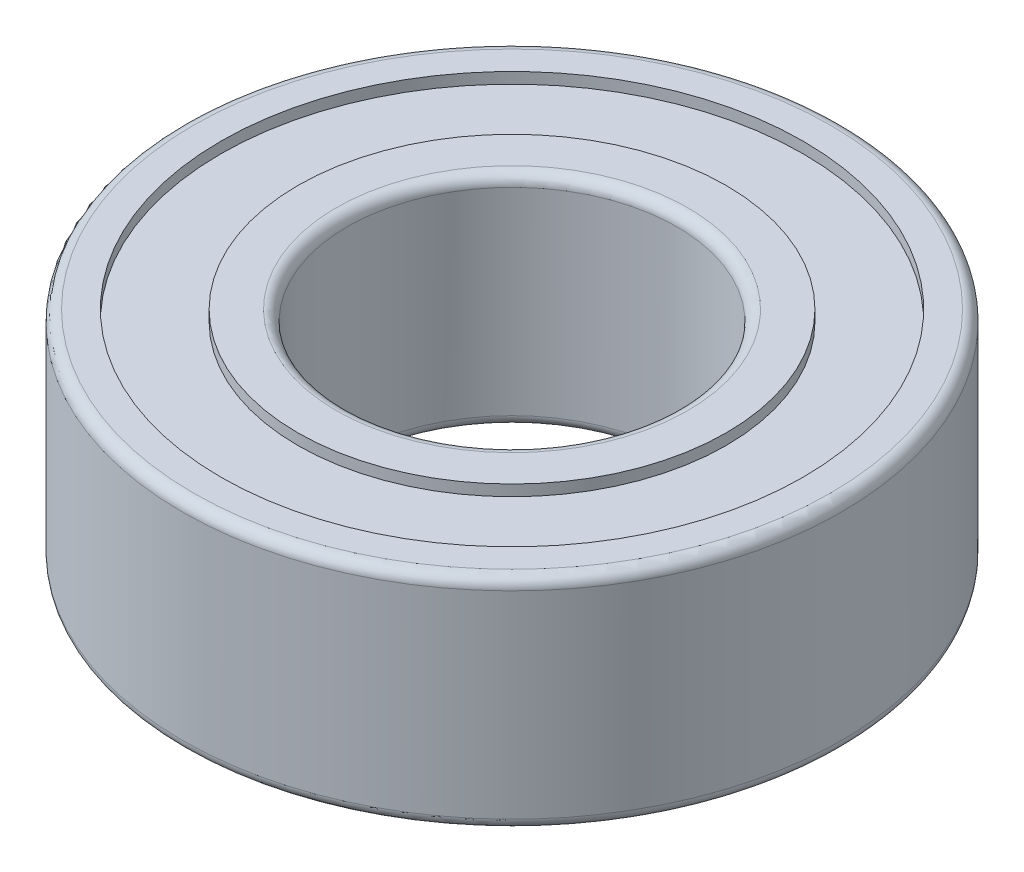
ISO-10303-21;
HEADER;
FILE_DESCRIPTION(('STEP AP214'),'2;1');
FILE_NAME('part.step','',(''),(''),'','','');
FILE_SCHEMA(('AUTOMOTIVE_DESIGN { 1 0 10303 214 1 1 1 1 }'));
ENDSEC;
DATA;
#1=APPLICATION_CONTEXT('core data for automotive mechanical design processes');
#2=APPLICATION_PROTOCOL_DEFINITION('international standard','automotive_design',2000,#1);
#3=PRODUCT_CONTEXT('',#1,'mechanical');
#4=PRODUCT('Part','Part','',(#3));
#5=PRODUCT_RELATED_PRODUCT_CATEGORY('part','',(#4));
#6=PRODUCT_DEFINITION_FORMATION('','',#4);
#7=PRODUCT_DEFINITION_CONTEXT('part definition',#1,'design');
#8=PRODUCT_DEFINITION('design','',#6,#7);
#9=PRODUCT_DEFINITION_SHAPE('','',#8);
#10=(LENGTH_UNIT() NAMED_UNIT(*) SI_UNIT(.MILLI.,.METRE.));
#11=(NAMED_UNIT(*) PLANE_ANGLE_UNIT() SI_UNIT($,.RADIAN.));
#12=(NAMED_UNIT(*) SI_UNIT($,.STERADIAN.) SOLID_ANGLE_UNIT());
#13=UNCERTAINTY_MEASURE_WITH_UNIT(LENGTH_MEASURE(1.E-05),#10,'distance_accuracy_value','');
#14=(GEOMETRIC_REPRESENTATION_CONTEXT(3) GLOBAL_UNCERTAINTY_ASSIGNED_CONTEXT((#13)) GLOBAL_UNIT_ASSIGNED_CONTEXT((#10,
#11,#12)) REPRESENTATION_CONTEXT('',''));
#15=CARTESIAN_POINT('',(0.,0.,0.));
#16=DIRECTION('',(0.,0.,1.));
#17=DIRECTION('',(1.,0.,0.));
#18=AXIS2_PLACEMENT_3D('',#15,#16,#17);
#19=CARTESIAN_POINT('',(0.,15.2038834951456,0.));
#20=DIRECTION('',(0.,1.,0.));
#21=DIRECTION('',(0.,0.,1.));
#22=AXIS2_PLACEMENT_3D('',#19,#20,#21);
#23=CYLINDRICAL_SURFACE('',#22,6.);
#24=CARTESIAN_POINT('',(0.,-1.8,0.));
#25=DIRECTION('',(0.,-1.,0.));
#26=DIRECTION('',(0.,0.,-1.));
#27=AXIS2_PLACEMENT_3D('',#24,#25,#26);
#28=CIRCLE('',#27,6.);
#29=CARTESIAN_POINT('',(0.,-1.8,-6.));
#30=VERTEX_POINT('',#29);
#31=EDGE_CURVE('E64',#30,#30,#28,.F.);
#32=ORIENTED_EDGE('',*,*,#31,.T.);
#33=EDGE_LOOP('',(#32));
#34=FACE_BOUND('',#33,.T.);
#35=CARTESIAN_POINT('',(0.,1.8,0.));
#36=DIRECTION('',(0.,1.,0.));
#37=DIRECTION('',(0.,0.,1.));
#38=AXIS2_PLACEMENT_3D('',#35,#36,#37);
#39=CIRCLE('',#38,6.);
#40=CARTESIAN_POINT('',(0.,1.8,6.));
#41=VERTEX_POINT('',#40);
#42=EDGE_CURVE('E78',#41,#41,#39,.F.);
#43=ORIENTED_EDGE('',*,*,#42,.T.);
#44=EDGE_LOOP('',(#43));
#45=FACE_BOUND('',#44,.T.);
#46=ADVANCED_FACE('F44',(#34,#45),#23,.T.);
#47=CARTESIAN_POINT('',(0.,2.,6.));
#48=DIRECTION('',(0.,1.,0.));
#49=DIRECTION('',(0.,0.,1.));
#50=AXIS2_PLACEMENT_3D('',#47,#48,#49);
#51=PLANE('',#50);
#52=CARTESIAN_POINT('',(0.,2.,0.));
#53=DIRECTION('',(0.,1.,0.));
#54=DIRECTION('',(0.,0.,1.));
#55=AXIS2_PLACEMENT_3D('',#52,#53,#54);
#56=CIRCLE('',#55,5.8);
#57=CARTESIAN_POINT('',(0.,2.,5.8));
#58=VERTEX_POINT('',#57);
#59=EDGE_CURVE('E81',#58,#58,#56,.T.);
#60=ORIENTED_EDGE('',*,*,#59,.T.);
#61=EDGE_LOOP('',(#60));
#62=FACE_BOUND('',#61,.T.);
#63=CARTESIAN_POINT('',(0.,2.,0.));
#64=DIRECTION('',(0.,1.,0.));
#65=DIRECTION('',(0.,0.,1.));
#66=AXIS2_PLACEMENT_3D('',#63,#64,#65);
#67=CIRCLE('',#66,5.3);
#68=CARTESIAN_POINT('',(0.,2.,5.3));
#69=VERTEX_POINT('',#68);
#70=EDGE_CURVE('E85',#69,#69,#67,.T.);
#71=ORIENTED_EDGE('',*,*,#70,.F.);
#72=EDGE_LOOP('',(#71));
#73=FACE_BOUND('',#72,.T.);
#74=ADVANCED_FACE('F132',(#62,#73),#51,.T.);
#75=CARTESIAN_POINT('',(0.,15.2038834951456,0.));
#76=DIRECTION('',(0.,1.,0.));
#77=DIRECTION('',(0.,0.,1.));
#78=AXIS2_PLACEMENT_3D('',#75,#76,#77);
#79=CYLINDRICAL_SURFACE('',#78,5.3);
#80=ORIENTED_EDGE('',*,*,#70,.T.);
#81=EDGE_LOOP('',(#80));
#82=FACE_BOUND('',#81,.T.);
#83=CARTESIAN_POINT('',(0.,1.8,0.));
#84=DIRECTION('',(0.,1.,0.));
#85=DIRECTION('',(0.,0.,1.));
#86=AXIS2_PLACEMENT_3D('',#83,#84,#85);
#87=CIRCLE('',#86,5.3);
#88=CARTESIAN_POINT('',(0.,1.8,5.3));
#89=VERTEX_POINT('',#88);
#90=EDGE_CURVE('E89',#89,#89,#87,.T.);
#91=ORIENTED_EDGE('',*,*,#90,.F.);
#92=EDGE_LOOP('',(#91));
#93=FACE_BOUND('',#92,.T.);
#94=ADVANCED_FACE('F138',(#82,#93),#79,.F.);
#95=CARTESIAN_POINT('',(0.,1.8,5.3));
#96=DIRECTION('',(0.,1.,0.));
#97=DIRECTION('',(0.,0.,1.));
#98=AXIS2_PLACEMENT_3D('',#95,#96,#97);
#99=PLANE('',#98);
#100=ORIENTED_EDGE('',*,*,#90,.T.);
#101=EDGE_LOOP('',(#100));
#102=FACE_BOUND('',#101,.T.);
#103=CARTESIAN_POINT('',(0.,1.8,0.));
#104=DIRECTION('',(0.,1.,0.));
#105=DIRECTION('',(0.,0.,1.));
#106=AXIS2_PLACEMENT_3D('',#103,#104,#105);
#107=CIRCLE('',#106,3.9);
#108=CARTESIAN_POINT('',(0.,1.8,3.9));
#109=VERTEX_POINT('',#108);
#110=EDGE_CURVE('E93',#109,#109,#107,.T.);
#111=ORIENTED_EDGE('',*,*,#110,.F.);
#112=EDGE_LOOP('',(#111));
#113=FACE_BOUND('',#112,.T.);
#114=ADVANCED_FACE('F176',(#102,#113),#99,.T.);
#115=CARTESIAN_POINT('',(0.,15.2038834951456,0.));
#116=DIRECTION('',(0.,1.,0.));
#117=DIRECTION('',(0.,0.,1.));
#118=AXIS2_PLACEMENT_3D('',#115,#116,#117);
#119=CYLINDRICAL_SURFACE('',#118,3.9);
#120=ORIENTED_EDGE('',*,*,#110,.T.);
#121=EDGE_LOOP('',(#120));
#122=FACE_BOUND('',#121,.T.);
#123=CARTESIAN_POINT('',(0.,2.,0.));
#124=DIRECTION('',(0.,1.,0.));
#125=DIRECTION('',(0.,0.,1.));
#126=AXIS2_PLACEMENT_3D('',#123,#124,#125);
#127=CIRCLE('',#126,3.9);
#128=CARTESIAN_POINT('',(0.,2.,3.9));
#129=VERTEX_POINT('',#128);
#130=EDGE_CURVE('E97',#129,#129,#127,.T.);
#131=ORIENTED_EDGE('',*,*,#130,.F.);
#132=EDGE_LOOP('',(#131));
#133=FACE_BOUND('',#132,.T.);
#134=ADVANCED_FACE('F169',(#122,#133),#119,.T.);
#135=CARTESIAN_POINT('',(0.,2.,3.9));
#136=DIRECTION('',(0.,1.,0.));
#137=DIRECTION('',(0.,0.,1.));
#138=AXIS2_PLACEMENT_3D('',#135,#136,#137);
#139=PLANE('',#138);
#140=CARTESIAN_POINT('',(0.,2.,0.));
#141=DIRECTION('',(0.,1.,0.));
#142=DIRECTION('',(0.,0.,1.));
#143=AXIS2_PLACEMENT_3D('',#140,#141,#142);
#144=CIRCLE('',#143,3.2);
#145=CARTESIAN_POINT('',(0.,2.,3.2));
#146=VERTEX_POINT('',#145);
#147=EDGE_CURVE('E70',#146,#146,#144,.F.);
#148=ORIENTED_EDGE('',*,*,#147,.T.);
#149=EDGE_LOOP('',(#148));
#150=FACE_BOUND('',#149,.T.);
#151=ORIENTED_EDGE('',*,*,#130,.T.);
#152=EDGE_LOOP('',(#151));
#153=FACE_BOUND('',#152,.T.);
#154=ADVANCED_FACE('F164',(#150,#153),#139,.T.);
#155=CARTESIAN_POINT('',(0.,15.2038834951456,0.));
#156=DIRECTION('',(0.,1.,0.));
#157=DIRECTION('',(0.,0.,1.));
#158=AXIS2_PLACEMENT_3D('',#155,#156,#157);
#159=CYLINDRICAL_SURFACE('',#158,3.);
#160=CARTESIAN_POINT('',(0.,-1.8,0.));
#161=DIRECTION('',(0.,-1.,0.));
#162=DIRECTION('',(0.,0.,-1.));
#163=AXIS2_PLACEMENT_3D('',#160,#161,#162);
#164=CIRCLE('',#163,3.);
#165=CARTESIAN_POINT('',(0.,-1.8,-3.));
#166=VERTEX_POINT('',#165);
#167=EDGE_CURVE('E10',#166,#166,#164,.T.);
#168=ORIENTED_EDGE('',*,*,#167,.T.);
#169=EDGE_LOOP('',(#168));
#170=FACE_BOUND('',#169,.T.);
#171=CARTESIAN_POINT('',(0.,1.8,0.));
#172=DIRECTION('',(0.,1.,0.));
#173=DIRECTION('',(0.,0.,1.));
#174=AXIS2_PLACEMENT_3D('',#171,#172,#173);
#175=CIRCLE('',#174,3.);
#176=CARTESIAN_POINT('',(0.,1.8,3.));
#177=VERTEX_POINT('',#176);
#178=EDGE_CURVE('E74',#177,#177,#175,.T.);
#179=ORIENTED_EDGE('',*,*,#178,.T.);
#180=EDGE_LOOP('',(#179));
#181=FACE_BOUND('',#180,.T.);
#182=ADVANCED_FACE('F148',(#170,#181),#159,.F.);
#183=CARTESIAN_POINT('',(0.,1.8,0.));
#184=DIRECTION('',(0.,1.,0.));
#185=DIRECTION('',(0.,0.,1.));
#186=AXIS2_PLACEMENT_3D('',#183,#184,#185);
#187=TOROIDAL_SURFACE('',#186,5.8,0.2);
#188=ORIENTED_EDGE('',*,*,#42,.F.);
#189=EDGE_LOOP('',(#188));
#190=FACE_BOUND('',#189,.T.);
#191=ORIENTED_EDGE('',*,*,#59,.F.);
#192=EDGE_LOOP('',(#191));
#193=FACE_BOUND('',#192,.T.);
#194=ADVANCED_FACE('F144',(#190,#193),#187,.T.);
#195=CARTESIAN_POINT('',(0.,1.8,0.));
#196=DIRECTION('',(0.,1.,0.));
#197=DIRECTION('',(0.,0.,1.));
#198=AXIS2_PLACEMENT_3D('',#195,#196,#197);
#199=TOROIDAL_SURFACE('',#198,3.2,0.2);
#200=ORIENTED_EDGE('',*,*,#147,.F.);
#201=EDGE_LOOP('',(#200));
#202=FACE_BOUND('',#201,.T.);
#203=ORIENTED_EDGE('',*,*,#178,.F.);
#204=EDGE_LOOP('',(#203));
#205=FACE_BOUND('',#204,.T.);
#206=ADVANCED_FACE('F147',(#202,#205),#199,.T.);
#207=CARTESIAN_POINT('',(0.,-2.,6.));
#208=DIRECTION('',(0.,-1.,0.));
#209=DIRECTION('',(0.,0.,1.));
#210=AXIS2_PLACEMENT_3D('',#207,#208,#209);
#211=PLANE('',#210);
#212=CARTESIAN_POINT('',(0.,-2.,0.));
#213=DIRECTION('',(0.,-1.,0.));
#214=DIRECTION('',(0.,0.,-1.));
#215=AXIS2_PLACEMENT_3D('',#212,#213,#214);
#216=CIRCLE('',#215,5.8);
#217=CARTESIAN_POINT('',(0.,-2.,-5.8));
#218=VERTEX_POINT('',#217);
#219=EDGE_CURVE('E58',#218,#218,#216,.T.);
#220=ORIENTED_EDGE('',*,*,#219,.T.);
#221=EDGE_LOOP('',(#220));
#222=FACE_BOUND('',#221,.T.);
#223=CARTESIAN_POINT('',(0.,-2.,0.));
#224=DIRECTION('',(0.,1.,0.));
#225=DIRECTION('',(0.,0.,1.));
#226=AXIS2_PLACEMENT_3D('',#223,#224,#225);
#227=CIRCLE('',#226,5.3);
#228=CARTESIAN_POINT('',(0.,-2.,5.3));
#229=VERTEX_POINT('',#228);
#230=EDGE_CURVE('E101',#229,#229,#227,.T.);
#231=ORIENTED_EDGE('',*,*,#230,.T.);
#232=EDGE_LOOP('',(#231));
#233=FACE_BOUND('',#232,.T.);
#234=ADVANCED_FACE('F151',(#222,#233),#211,.T.);
#235=CARTESIAN_POINT('',(0.,-15.2038834951456,0.));
#236=DIRECTION('',(0.,-1.,0.));
#237=DIRECTION('',(0.,0.,1.));
#238=AXIS2_PLACEMENT_3D('',#235,#236,#237);
#239=CYLINDRICAL_SURFACE('',#238,5.3);
#240=ORIENTED_EDGE('',*,*,#230,.F.);
#241=EDGE_LOOP('',(#240));
#242=FACE_BOUND('',#241,.T.);
#243=CARTESIAN_POINT('',(0.,-1.8,0.));
#244=DIRECTION('',(0.,1.,0.));
#245=DIRECTION('',(0.,0.,1.));
#246=AXIS2_PLACEMENT_3D('',#243,#244,#245);
#247=CIRCLE('',#246,5.3);
#248=CARTESIAN_POINT('',(0.,-1.8,5.3));
#249=VERTEX_POINT('',#248);
#250=EDGE_CURVE('E105',#249,#249,#247,.T.);
#251=ORIENTED_EDGE('',*,*,#250,.T.);
#252=EDGE_LOOP('',(#251));
#253=FACE_BOUND('',#252,.T.);
#254=ADVANCED_FACE('F156',(#242,#253),#239,.F.);
#255=CARTESIAN_POINT('',(0.,-1.8,5.3));
#256=DIRECTION('',(0.,-1.,0.));
#257=DIRECTION('',(0.,0.,1.));
#258=AXIS2_PLACEMENT_3D('',#255,#256,#257);
#259=PLANE('',#258);
#260=ORIENTED_EDGE('',*,*,#250,.F.);
#261=EDGE_LOOP('',(#260));
#262=FACE_BOUND('',#261,.T.);
#263=CARTESIAN_POINT('',(0.,-1.8,0.));
#264=DIRECTION('',(0.,1.,0.));
#265=DIRECTION('',(0.,0.,1.));
#266=AXIS2_PLACEMENT_3D('',#263,#264,#265);
#267=CIRCLE('',#266,3.9);
#268=CARTESIAN_POINT('',(0.,-1.8,3.9));
#269=VERTEX_POINT('',#268);
#270=EDGE_CURVE('E109',#269,#269,#267,.T.);
#271=ORIENTED_EDGE('',*,*,#270,.T.);
#272=EDGE_LOOP('',(#271));
#273=FACE_BOUND('',#272,.T.);
#274=ADVANCED_FACE('F128',(#262,#273),#259,.T.);
#275=CARTESIAN_POINT('',(0.,-15.2038834951456,0.));
#276=DIRECTION('',(0.,-1.,0.));
#277=DIRECTION('',(0.,0.,1.));
#278=AXIS2_PLACEMENT_3D('',#275,#276,#277);
#279=CYLINDRICAL_SURFACE('',#278,3.9);
#280=ORIENTED_EDGE('',*,*,#270,.F.);
#281=EDGE_LOOP('',(#280));
#282=FACE_BOUND('',#281,.T.);
#283=CARTESIAN_POINT('',(0.,-2.,0.));
#284=DIRECTION('',(0.,1.,0.));
#285=DIRECTION('',(0.,0.,1.));
#286=AXIS2_PLACEMENT_3D('',#283,#284,#285);
#287=CIRCLE('',#286,3.9);
#288=CARTESIAN_POINT('',(0.,-2.,3.9));
#289=VERTEX_POINT('',#288);
#290=EDGE_CURVE('E112',#289,#289,#287,.T.);
#291=ORIENTED_EDGE('',*,*,#290,.T.);
#292=EDGE_LOOP('',(#291));
#293=FACE_BOUND('',#292,.T.);
#294=ADVANCED_FACE('F117',(#282,#293),#279,.T.);
#295=CARTESIAN_POINT('',(0.,-2.,3.9));
#296=DIRECTION('',(0.,-1.,0.));
#297=DIRECTION('',(0.,0.,1.));
#298=AXIS2_PLACEMENT_3D('',#295,#296,#297);
#299=PLANE('',#298);
#300=CARTESIAN_POINT('',(0.,-2.,0.));
#301=DIRECTION('',(0.,-1.,0.));
#302=DIRECTION('',(0.,0.,-1.));
#303=AXIS2_PLACEMENT_3D('',#300,#301,#302);
#304=CIRCLE('',#303,3.2);
#305=CARTESIAN_POINT('',(0.,-2.,-3.2));
#306=VERTEX_POINT('',#305);
#307=EDGE_CURVE('E52',#306,#306,#304,.F.);
#308=ORIENTED_EDGE('',*,*,#307,.T.);
#309=EDGE_LOOP('',(#308));
#310=FACE_BOUND('',#309,.T.);
#311=ORIENTED_EDGE('',*,*,#290,.F.);
#312=EDGE_LOOP('',(#311));
#313=FACE_BOUND('',#312,.T.);
#314=ADVANCED_FACE('F119',(#310,#313),#299,.T.);
#315=CARTESIAN_POINT('',(0.,-1.8,0.));
#316=DIRECTION('',(0.,-1.,0.));
#317=DIRECTION('',(0.,0.,-1.));
#318=AXIS2_PLACEMENT_3D('',#315,#316,#317);
#319=TOROIDAL_SURFACE('',#318,5.8,0.2);
#320=ORIENTED_EDGE('',*,*,#219,.F.);
#321=EDGE_LOOP('',(#320));
#322=FACE_BOUND('',#321,.T.);
#323=ORIENTED_EDGE('',*,*,#31,.F.);
#324=EDGE_LOOP('',(#323));
#325=FACE_BOUND('',#324,.T.);
#326=ADVANCED_FACE('F121',(#322,#325),#319,.T.);
#327=CARTESIAN_POINT('',(0.,-1.8,0.));
#328=DIRECTION('',(0.,-1.,0.));
#329=DIRECTION('',(0.,0.,-1.));
#330=AXIS2_PLACEMENT_3D('',#327,#328,#329);
#331=TOROIDAL_SURFACE('',#330,3.2,0.2);
#332=ORIENTED_EDGE('',*,*,#167,.F.);
#333=EDGE_LOOP('',(#332));
#334=FACE_BOUND('',#333,.T.);
#335=ORIENTED_EDGE('',*,*,#307,.F.);
#336=EDGE_LOOP('',(#335));
#337=FACE_BOUND('',#336,.T.);
#338=ADVANCED_FACE('F46',(#334,#337),#331,.T.);
#339=CLOSED_SHELL('',(#46,#74,#94,#114,#134,#154,#182,#194,#206,#234,#254,#274,#294,#314,#326,#338));
#340=MANIFOLD_SOLID_BREP('B2',#339);
#341=ADVANCED_BREP_SHAPE_REPRESENTATION('',(#18,#340),#14);
#342=SHAPE_DEFINITION_REPRESENTATION(#9,#341);
ENDSEC;
END-ISO-10303-21;
